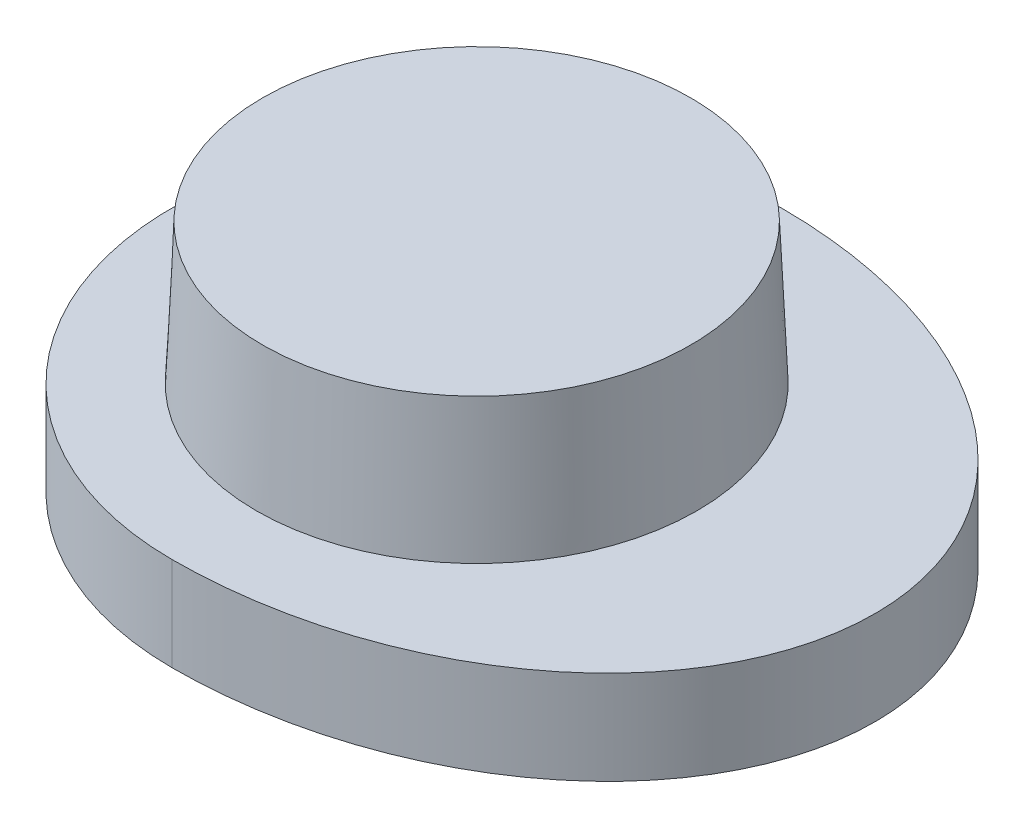
ISO-10303-21;
HEADER;
FILE_DESCRIPTION(('STEP AP214'),'2;1');
FILE_NAME('part.step','',(''),(''),'','','');
FILE_SCHEMA(('AUTOMOTIVE_DESIGN { 1 0 10303 214 1 1 1 1 }'));
ENDSEC;
DATA;
#1=APPLICATION_CONTEXT('core data for automotive mechanical design processes');
#2=APPLICATION_PROTOCOL_DEFINITION('international standard','automotive_design',2000,#1);
#3=PRODUCT_CONTEXT('',#1,'mechanical');
#4=PRODUCT('Part','Part','',(#3));
#5=PRODUCT_RELATED_PRODUCT_CATEGORY('part','',(#4));
#6=PRODUCT_DEFINITION_FORMATION('','',#4);
#7=PRODUCT_DEFINITION_CONTEXT('part definition',#1,'design');
#8=PRODUCT_DEFINITION('design','',#6,#7);
#9=PRODUCT_DEFINITION_SHAPE('','',#8);
#10=(LENGTH_UNIT() NAMED_UNIT(*) SI_UNIT(.MILLI.,.METRE.));
#11=(NAMED_UNIT(*) PLANE_ANGLE_UNIT() SI_UNIT($,.RADIAN.));
#12=(NAMED_UNIT(*) SI_UNIT($,.STERADIAN.) SOLID_ANGLE_UNIT());
#13=UNCERTAINTY_MEASURE_WITH_UNIT(LENGTH_MEASURE(1.E-05),#10,'distance_accuracy_value','');
#14=(GEOMETRIC_REPRESENTATION_CONTEXT(3) GLOBAL_UNCERTAINTY_ASSIGNED_CONTEXT((#13)) GLOBAL_UNIT_ASSIGNED_CONTEXT((#10,
#11,#12)) REPRESENTATION_CONTEXT('',''));
#15=CARTESIAN_POINT('',(0.,0.,0.));
#16=DIRECTION('',(0.,0.,1.));
#17=DIRECTION('',(1.,0.,0.));
#18=AXIS2_PLACEMENT_3D('',#15,#16,#17);
#19=CARTESIAN_POINT('',(11.1741653222858,1.0129725587003,-1.79627504741535E-06));
#20=DIRECTION('',(0.,1.,0.));
#21=DIRECTION('',(-1.,0.,0.));
#22=AXIS2_PLACEMENT_3D('',#19,#20,#21);
#23=PLANE('',#22);
#24=CARTESIAN_POINT('',(22.4133703305258,1.0129725587003,-1.79627504741535E-06));
#25=DIRECTION('',(0.,1.,0.));
#26=DIRECTION('',(-1.,0.,0.));
#27=AXIS2_PLACEMENT_3D('',#24,#25,#26);
#28=CIRCLE('',#27,2.04349181968);
#29=CARTESIAN_POINT('',(20.3698785108458,1.0129725587003,-1.79627504741535E-06));
#30=VERTEX_POINT('',#29);
#31=EDGE_CURVE('E11',#30,#30,#28,.T.);
#32=ORIENTED_EDGE('',*,*,#31,.F.);
#33=EDGE_LOOP('',(#32));
#34=FACE_BOUND('',#33,.T.);
#35=ADVANCED_FACE('F42',(#34),#23,.F.);
#36=CARTESIAN_POINT('',(22.4133703305258,9.16423521154573,-1.79627504741535E-06));
#37=DIRECTION('',(0.,1.,0.));
#38=DIRECTION('',(-1.,0.,0.));
#39=AXIS2_PLACEMENT_3D('',#36,#37,#38);
#40=CYLINDRICAL_SURFACE('',#39,2.04349181968);
#41=CARTESIAN_POINT('',(22.4133703305258,-1.0305192609797,-1.79627504741535E-06));
#42=DIRECTION('',(0.,1.,0.));
#43=DIRECTION('',(-1.,0.,0.));
#44=AXIS2_PLACEMENT_3D('',#41,#42,#43);
#45=CIRCLE('',#44,2.04349181968);
#46=CARTESIAN_POINT('',(20.3698785108458,-1.0305192609797,-1.79627504741535E-06));
#47=VERTEX_POINT('',#46);
#48=EDGE_CURVE('E50',#47,#47,#45,.T.);
#49=ORIENTED_EDGE('',*,*,#48,.F.);
#50=EDGE_LOOP('',(#49));
#51=FACE_BOUND('',#50,.T.);
#52=ORIENTED_EDGE('',*,*,#31,.T.);
#53=EDGE_LOOP('',(#52));
#54=FACE_BOUND('',#53,.T.);
#55=ADVANCED_FACE('F101',(#51,#54),#40,.F.);
#56=CARTESIAN_POINT('',(11.1741653222858,-1.0305192609797,-1.79627504741535E-06));
#57=DIRECTION('',(0.,1.,0.));
#58=DIRECTION('',(-1.,0.,0.));
#59=AXIS2_PLACEMENT_3D('',#56,#57,#58);
#60=PLANE('',#59);
#61=CARTESIAN_POINT('',(22.4133703305258,-1.0305192609797,-1.79627504741535E-06));
#62=DIRECTION('',(0.,-1.,0.));
#63=DIRECTION('',(-1.,0.,0.));
#64=AXIS2_PLACEMENT_3D('',#61,#62,#63);
#65=ELLIPSE('',#64,4.34242011682,3.32067420698);
#66=CARTESIAN_POINT('',(22.4133703305258,-1.0305192609797,-3.32067600325505));
#67=VERTEX_POINT('',#66);
#68=CARTESIAN_POINT('',(22.4133703305258,-1.0305192609797,3.32067241070495));
#69=VERTEX_POINT('',#68);
#70=EDGE_CURVE('E57',#67,#69,#65,.T.);
#71=ORIENTED_EDGE('',*,*,#70,.T.);
#72=CARTESIAN_POINT('',(22.4133703305258,-1.0305192609797,-1.79627504741535E-06));
#73=DIRECTION('',(0.,1.,0.));
#74=DIRECTION('',(-1.,0.,0.));
#75=AXIS2_PLACEMENT_3D('',#72,#73,#74);
#76=CIRCLE('',#75,3.32067420698);
#77=EDGE_CURVE('E86',#67,#69,#76,.T.);
#78=ORIENTED_EDGE('',*,*,#77,.F.);
#79=EDGE_LOOP('',(#71,#78));
#80=FACE_BOUND('',#79,.T.);
#81=ORIENTED_EDGE('',*,*,#48,.T.);
#82=EDGE_LOOP('',(#81));
#83=FACE_BOUND('',#82,.T.);
#84=ADVANCED_FACE('F99',(#80,#83),#60,.F.);
#85=CARTESIAN_POINT('',(22.4133703305258,9.16423521154573,-1.79627504741535E-06));
#86=DIRECTION('',(0.,1.,0.));
#87=DIRECTION('',(-1.,0.,0.));
#88=AXIS2_PLACEMENT_3D('',#85,#86,#87);
#89=CYLINDRICAL_SURFACE('',#88,3.32067420698);
#90=DIRECTION('',(0.,-1.,0.));
#91=VECTOR('',#90,1.);
#92=CARTESIAN_POINT('',(22.4133703305258,7.92623725327699,3.32067241070495));
#93=LINE('',#92,#91);
#94=CARTESIAN_POINT('',(22.4133703305258,-0.00875620775194507,3.32067241070495));
#95=VERTEX_POINT('',#94);
#96=EDGE_CURVE('E63',#95,#69,#93,.T.);
#97=ORIENTED_EDGE('',*,*,#96,.F.);
#98=CARTESIAN_POINT('',(22.4133703305258,-0.00875620775194685,-1.79627504741535E-06));
#99=DIRECTION('',(0.,1.,0.));
#100=DIRECTION('',(-1.,0.,0.));
#101=AXIS2_PLACEMENT_3D('',#98,#99,#100);
#102=CIRCLE('',#101,3.32067420698);
#103=CARTESIAN_POINT('',(22.4133703305258,-0.00875620775194685,-3.32067600325505));
#104=VERTEX_POINT('',#103);
#105=EDGE_CURVE('E73',#104,#95,#102,.T.);
#106=ORIENTED_EDGE('',*,*,#105,.F.);
#107=DIRECTION('',(0.,-1.,0.));
#108=VECTOR('',#107,1.);
#109=CARTESIAN_POINT('',(22.4133703305258,7.92623725327699,-3.32067600325505));
#110=LINE('',#109,#108);
#111=EDGE_CURVE('E76',#104,#67,#110,.T.);
#112=ORIENTED_EDGE('',*,*,#111,.T.);
#113=ORIENTED_EDGE('',*,*,#77,.T.);
#114=EDGE_LOOP('',(#97,#106,#112,#113));
#115=FACE_BOUND('',#114,.T.);
#116=ADVANCED_FACE('F84',(#115),#89,.T.);
#117=CARTESIAN_POINT('',(11.1741653222858,-0.00875620775194963,-1.79627504741535E-06));
#118=DIRECTION('',(0.,1.,0.));
#119=DIRECTION('',(-1.,0.,0.));
#120=AXIS2_PLACEMENT_3D('',#117,#118,#119);
#121=PLANE('',#120);
#122=ORIENTED_EDGE('',*,*,#105,.T.);
#123=CARTESIAN_POINT('',(22.4133703305258,-0.00875620775194685,-1.79627504741535E-06));
#124=DIRECTION('',(0.,-1.,0.));
#125=DIRECTION('',(-1.,0.,0.));
#126=AXIS2_PLACEMENT_3D('',#123,#124,#125);
#127=ELLIPSE('',#126,4.34242011682,3.32067420698);
#128=EDGE_CURVE('E69',#104,#95,#127,.T.);
#129=ORIENTED_EDGE('',*,*,#128,.F.);
#130=EDGE_LOOP('',(#122,#129));
#131=FACE_BOUND('',#130,.T.);
#132=CARTESIAN_POINT('',(22.4133703305258,-0.00875620775195039,-1.79627504741535E-06));
#133=DIRECTION('',(0.,1.,0.));
#134=DIRECTION('',(-1.,0.,0.));
#135=AXIS2_PLACEMENT_3D('',#132,#133,#134);
#136=CIRCLE('',#135,2.401102888124);
#137=CARTESIAN_POINT('',(20.0122674424018,-0.00875620775195062,-1.79627504741535E-06));
#138=VERTEX_POINT('',#137);
#139=EDGE_CURVE('E87',#138,#138,#136,.T.);
#140=ORIENTED_EDGE('',*,*,#139,.F.);
#141=EDGE_LOOP('',(#140));
#142=FACE_BOUND('',#141,.T.);
#143=ADVANCED_FACE('F70',(#131,#142),#121,.T.);
#144=CARTESIAN_POINT('',(22.4133703305258,1.5238455136203,-1.79627504741535E-06));
#145=DIRECTION('',(0.,-1.,0.));
#146=DIRECTION('',(1.,0.,0.));
#147=AXIS2_PLACEMENT_3D('',#144,#145,#146);
#148=CONICAL_SURFACE('',#147,2.33418805186569,0.0436332312998501);
#149=ORIENTED_EDGE('',*,*,#139,.T.);
#150=EDGE_LOOP('',(#149));
#151=FACE_BOUND('',#150,.T.);
#152=CARTESIAN_POINT('',(22.4133703305258,1.5238455136203,-1.79627504741535E-06));
#153=DIRECTION('',(0.,1.,0.));
#154=DIRECTION('',(-1.,0.,0.));
#155=AXIS2_PLACEMENT_3D('',#152,#153,#154);
#156=CIRCLE('',#155,2.33418805186569);
#157=CARTESIAN_POINT('',(20.0791822786601,1.5238455136203,-1.79627504741535E-06));
#158=VERTEX_POINT('',#157);
#159=EDGE_CURVE('E82',#158,#158,#156,.T.);
#160=ORIENTED_EDGE('',*,*,#159,.F.);
#161=EDGE_LOOP('',(#160));
#162=FACE_BOUND('',#161,.T.);
#163=ADVANCED_FACE('F132',(#151,#162),#148,.T.);
#164=CARTESIAN_POINT('',(11.1741653222858,1.5238455136203,-1.79627504741535E-06));
#165=DIRECTION('',(0.,-1.,0.));
#166=DIRECTION('',(1.,0.,0.));
#167=AXIS2_PLACEMENT_3D('',#164,#165,#166);
#168=PLANE('',#167);
#169=ORIENTED_EDGE('',*,*,#159,.T.);
#170=EDGE_LOOP('',(#169));
#171=FACE_BOUND('',#170,.T.);
#172=ADVANCED_FACE('F139',(#171),#168,.F.);
#173=CARTESIAN_POINT('',(22.4133703305258,7.92623725327699,-1.79627504741535E-06));
#174=DIRECTION('',(0.,-1.,0.));
#175=DIRECTION('',(-1.,0.,0.));
#176=AXIS2_PLACEMENT_3D('',#173,#174,#175);
#177=ELLIPSE('',#176,4.34242011682,3.32067420698);
#178=DIRECTION('',(0.,-1.,0.));
#179=VECTOR('',#178,1.);
#180=SURFACE_OF_LINEAR_EXTRUSION('',#177,#179);
#181=ORIENTED_EDGE('',*,*,#111,.F.);
#182=ORIENTED_EDGE('',*,*,#128,.T.);
#183=ORIENTED_EDGE('',*,*,#96,.T.);
#184=ORIENTED_EDGE('',*,*,#70,.F.);
#185=EDGE_LOOP('',(#181,#182,#183,#184));
#186=FACE_BOUND('',#185,.T.);
#187=ADVANCED_FACE('F77',(#186),#180,.T.);
#188=CLOSED_SHELL('',(#35,#55,#84,#116,#143,#163,#172,#187));
#189=MANIFOLD_SOLID_BREP('B2',#188);
#190=ADVANCED_BREP_SHAPE_REPRESENTATION('',(#18,#189),#14);
#191=SHAPE_DEFINITION_REPRESENTATION(#9,#190);
ENDSEC;
END-ISO-10303-21;
